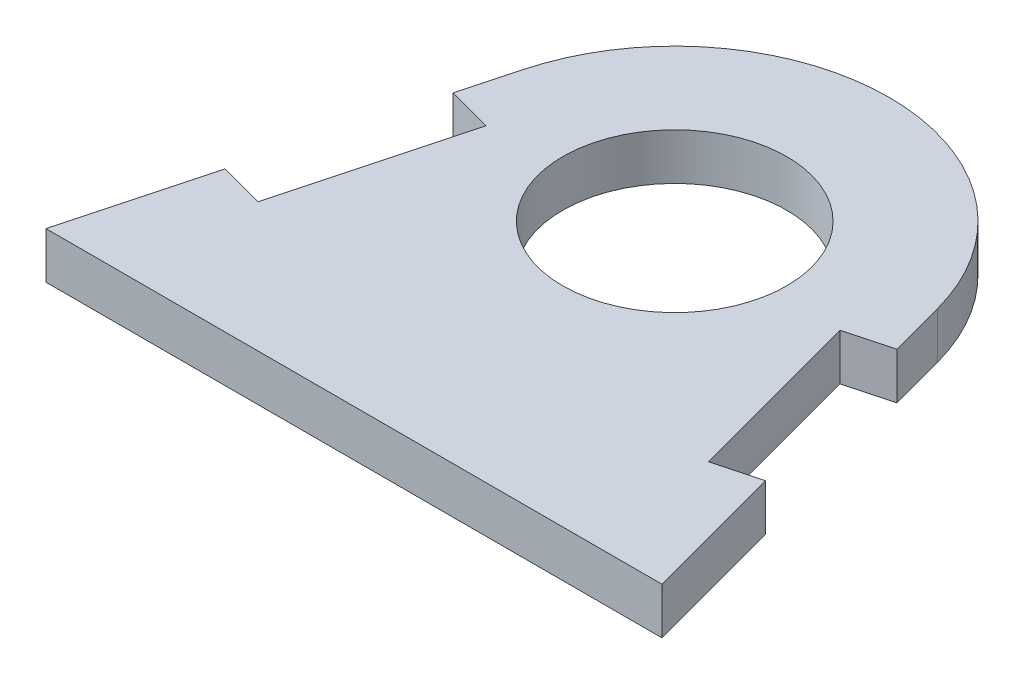
ISO-10303-21;
HEADER;
FILE_DESCRIPTION(('STEP AP214'),'2;1');
FILE_NAME('part.step','',(''),(''),'','','');
FILE_SCHEMA(('AUTOMOTIVE_DESIGN { 1 0 10303 214 1 1 1 1 }'));
ENDSEC;
DATA;
#1=APPLICATION_CONTEXT('core data for automotive mechanical design processes');
#2=APPLICATION_PROTOCOL_DEFINITION('international standard','automotive_design',2000,#1);
#3=PRODUCT_CONTEXT('',#1,'mechanical');
#4=PRODUCT('Part','Part','',(#3));
#5=PRODUCT_RELATED_PRODUCT_CATEGORY('part','',(#4));
#6=PRODUCT_DEFINITION_FORMATION('','',#4);
#7=PRODUCT_DEFINITION_CONTEXT('part definition',#1,'design');
#8=PRODUCT_DEFINITION('design','',#6,#7);
#9=PRODUCT_DEFINITION_SHAPE('','',#8);
#10=(LENGTH_UNIT() NAMED_UNIT(*) SI_UNIT(.MILLI.,.METRE.));
#11=(NAMED_UNIT(*) PLANE_ANGLE_UNIT() SI_UNIT($,.RADIAN.));
#12=(NAMED_UNIT(*) SI_UNIT($,.STERADIAN.) SOLID_ANGLE_UNIT());
#13=UNCERTAINTY_MEASURE_WITH_UNIT(LENGTH_MEASURE(1.E-05),#10,'distance_accuracy_value','');
#14=(GEOMETRIC_REPRESENTATION_CONTEXT(3) GLOBAL_UNCERTAINTY_ASSIGNED_CONTEXT((#13)) GLOBAL_UNIT_ASSIGNED_CONTEXT((#10,
#11,#12)) REPRESENTATION_CONTEXT('',''));
#15=CARTESIAN_POINT('',(0.,0.,0.));
#16=DIRECTION('',(0.,0.,1.));
#17=DIRECTION('',(1.,0.,0.));
#18=AXIS2_PLACEMENT_3D('',#15,#16,#17);
#19=CARTESIAN_POINT('',(0.,1.5875,-21.9125));
#20=DIRECTION('',(0.,-1.,0.));
#21=DIRECTION('',(0.,0.,-1.));
#22=AXIS2_PLACEMENT_3D('',#19,#20,#21);
#23=CYLINDRICAL_SURFACE('',#22,14.65);
#24=CARTESIAN_POINT('',(0.,-1.5875,-21.9125));
#25=DIRECTION('',(0.,1.,0.));
#26=DIRECTION('',(0.,0.,1.));
#27=AXIS2_PLACEMENT_3D('',#24,#25,#26);
#28=CIRCLE('',#27,14.65);
#29=CARTESIAN_POINT('',(-14.1508133551348,-1.5875,-25.704199010752));
#30=VERTEX_POINT('',#29);
#31=CARTESIAN_POINT('',(14.1508133551348,-1.5875,-25.704199010752));
#32=VERTEX_POINT('',#31);
#33=EDGE_CURVE('E162',#30,#32,#28,.F.);
#34=ORIENTED_EDGE('',*,*,#33,.F.);
#35=DIRECTION('',(0.,-1.,0.));
#36=VECTOR('',#35,1.);
#37=CARTESIAN_POINT('',(-14.1508133551348,1.5875,-25.704199010752));
#38=LINE('',#37,#36);
#39=CARTESIAN_POINT('',(-14.1508133551348,1.5875,-25.704199010752));
#40=VERTEX_POINT('',#39);
#41=EDGE_CURVE('E11',#40,#30,#38,.T.);
#42=ORIENTED_EDGE('',*,*,#41,.F.);
#43=CARTESIAN_POINT('',(0.,1.5875,-21.9125));
#44=DIRECTION('',(0.,1.,0.));
#45=DIRECTION('',(0.,0.,1.));
#46=AXIS2_PLACEMENT_3D('',#43,#44,#45);
#47=CIRCLE('',#46,14.65);
#48=CARTESIAN_POINT('',(14.1508133551348,1.5875,-25.704199010752));
#49=VERTEX_POINT('',#48);
#50=EDGE_CURVE('E191',#40,#49,#47,.F.);
#51=ORIENTED_EDGE('',*,*,#50,.T.);
#52=DIRECTION('',(0.,-1.,0.));
#53=VECTOR('',#52,1.);
#54=CARTESIAN_POINT('',(14.1508133551348,1.5875,-25.704199010752));
#55=LINE('',#54,#53);
#56=EDGE_CURVE('E103',#49,#32,#55,.T.);
#57=ORIENTED_EDGE('',*,*,#56,.T.);
#58=EDGE_LOOP('',(#34,#42,#51,#57));
#59=FACE_BOUND('',#58,.T.);
#60=ADVANCED_FACE('F41',(#59),#23,.T.);
#61=CARTESIAN_POINT('',(-19.6289383551349,1.5875,-5.25955818053877));
#62=DIRECTION('',(-0.965925826289067,0.,-0.258819045102524));
#63=DIRECTION('',(-0.258819045102524,0.,0.965925826289067));
#64=AXIS2_PLACEMENT_3D('',#61,#62,#63);
#65=PLANE('',#64);
#66=DIRECTION('',(0.258819045102524,0.,-0.965925826289067));
#67=VECTOR('',#66,1.);
#68=CARTESIAN_POINT('',(-19.6289383551349,-1.5875,-5.25955818053877));
#69=LINE('',#68,#67);
#70=CARTESIAN_POINT('',(-15.1630403983275,-1.5875,-21.9265162567618));
#71=VERTEX_POINT('',#70);
#72=EDGE_CURVE('E165',#71,#30,#69,.T.);
#73=ORIENTED_EDGE('',*,*,#72,.F.);
#74=DIRECTION('',(0.,-1.,0.));
#75=VECTOR('',#74,1.);
#76=CARTESIAN_POINT('',(-15.1630403983275,1.5875,-21.9265162567618));
#77=LINE('',#76,#75);
#78=CARTESIAN_POINT('',(-15.1630403983275,1.5875,-21.9265162567618));
#79=VERTEX_POINT('',#78);
#80=EDGE_CURVE('E49',#79,#71,#77,.T.);
#81=ORIENTED_EDGE('',*,*,#80,.F.);
#82=DIRECTION('',(0.258819045102524,0.,-0.965925826289067));
#83=VECTOR('',#82,1.);
#84=CARTESIAN_POINT('',(-19.6289383551349,1.5875,-5.25955818053877));
#85=LINE('',#84,#83);
#86=EDGE_CURVE('E224',#79,#40,#85,.T.);
#87=ORIENTED_EDGE('',*,*,#86,.T.);
#88=ORIENTED_EDGE('',*,*,#41,.T.);
#89=EDGE_LOOP('',(#73,#81,#87,#88));
#90=FACE_BOUND('',#89,.T.);
#91=ADVANCED_FACE('F223',(#90),#65,.T.);
#92=CARTESIAN_POINT('',(4.46589795680742,1.5875,-16.6669580762231));
#93=DIRECTION('',(0.258819045102525,0.,-0.965925826289067));
#94=DIRECTION('',(-0.965925826289067,0.,-0.258819045102525));
#95=AXIS2_PLACEMENT_3D('',#92,#93,#94);
#96=PLANE('',#95);
#97=DIRECTION('',(0.965925826289067,0.,0.258819045102525));
#98=VECTOR('',#97,1.);
#99=CARTESIAN_POINT('',(4.46589795680742,-1.5875,-16.6669580762231));
#100=LINE('',#99,#98);
#101=CARTESIAN_POINT('',(-12.0962258998597,-1.5875,-21.1047657885613));
#102=VERTEX_POINT('',#101);
#103=EDGE_CURVE('E168',#71,#102,#100,.T.);
#104=ORIENTED_EDGE('',*,*,#103,.T.);
#105=DIRECTION('',(0.,-1.,0.));
#106=VECTOR('',#105,1.);
#107=CARTESIAN_POINT('',(-12.0962258998597,1.5875,-21.1047657885613));
#108=LINE('',#107,#106);
#109=CARTESIAN_POINT('',(-12.0962258998597,1.5875,-21.1047657885613));
#110=VERTEX_POINT('',#109);
#111=EDGE_CURVE('E207',#110,#102,#108,.T.);
#112=ORIENTED_EDGE('',*,*,#111,.F.);
#113=DIRECTION('',(0.965925826289067,0.,0.258819045102525));
#114=VECTOR('',#113,1.);
#115=CARTESIAN_POINT('',(4.46589795680742,1.5875,-16.6669580762231));
#116=LINE('',#115,#114);
#117=EDGE_CURVE('E214',#79,#110,#116,.T.);
#118=ORIENTED_EDGE('',*,*,#117,.F.);
#119=ORIENTED_EDGE('',*,*,#80,.T.);
#120=EDGE_LOOP('',(#104,#112,#118,#119));
#121=FACE_BOUND('',#120,.T.);
#122=ADVANCED_FACE('F212',(#121),#96,.F.);
#123=CARTESIAN_POINT('',(-16.5621238566671,1.5875,-4.43780771233826));
#124=DIRECTION('',(0.965925826289067,0.,0.258819045102524));
#125=DIRECTION('',(0.258819045102525,0.,-0.965925826289067));
#126=AXIS2_PLACEMENT_3D('',#123,#124,#125);
#127=PLANE('',#126);
#128=DIRECTION('',(-0.258819045102525,0.,0.965925826289067));
#129=VECTOR('',#128,1.);
#130=CARTESIAN_POINT('',(-16.5621238566671,-1.5875,-4.43780771233826));
#131=LINE('',#130,#129);
#132=CARTESIAN_POINT('',(-15.3832277726618,-1.5875,-8.83750779469016));
#133=VERTEX_POINT('',#132);
#134=EDGE_CURVE('E171',#102,#133,#131,.T.);
#135=ORIENTED_EDGE('',*,*,#134,.T.);
#136=DIRECTION('',(0.,-1.,0.));
#137=VECTOR('',#136,1.);
#138=CARTESIAN_POINT('',(-15.3832277726618,1.5875,-8.83750779469016));
#139=LINE('',#138,#137);
#140=CARTESIAN_POINT('',(-15.3832277726618,1.5875,-8.83750779469016));
#141=VERTEX_POINT('',#140);
#142=EDGE_CURVE('E205',#141,#133,#139,.T.);
#143=ORIENTED_EDGE('',*,*,#142,.F.);
#144=DIRECTION('',(-0.258819045102525,0.,0.965925826289067));
#145=VECTOR('',#144,1.);
#146=CARTESIAN_POINT('',(-16.5621238566671,1.5875,-4.43780771233826));
#147=LINE('',#146,#145);
#148=EDGE_CURVE('E231',#110,#141,#147,.T.);
#149=ORIENTED_EDGE('',*,*,#148,.F.);
#150=ORIENTED_EDGE('',*,*,#111,.T.);
#151=EDGE_LOOP('',(#135,#143,#149,#150));
#152=FACE_BOUND('',#151,.T.);
#153=ADVANCED_FACE('F262',(#152),#127,.F.);
#154=CARTESIAN_POINT('',(1.17889608400536,1.5875,-4.39970008235191));
#155=DIRECTION('',(0.258819045102524,0.,-0.965925826289067));
#156=DIRECTION('',(-0.965925826289067,0.,-0.258819045102524));
#157=AXIS2_PLACEMENT_3D('',#154,#155,#156);
#158=PLANE('',#157);
#159=DIRECTION('',(0.965925826289067,0.,0.258819045102524));
#160=VECTOR('',#159,1.);
#161=CARTESIAN_POINT('',(1.17889608400536,-1.5875,-4.39970008235191));
#162=LINE('',#161,#160);
#163=CARTESIAN_POINT('',(-18.4500422711296,-1.5875,-9.65925826289068));
#164=VERTEX_POINT('',#163);
#165=EDGE_CURVE('E174',#164,#133,#162,.T.);
#166=ORIENTED_EDGE('',*,*,#165,.F.);
#167=DIRECTION('',(0.,-1.,0.));
#168=VECTOR('',#167,1.);
#169=CARTESIAN_POINT('',(-18.4500422711296,1.5875,-9.65925826289068));
#170=LINE('',#169,#168);
#171=CARTESIAN_POINT('',(-18.4500422711296,1.5875,-9.65925826289068));
#172=VERTEX_POINT('',#171);
#173=EDGE_CURVE('E203',#172,#164,#170,.T.);
#174=ORIENTED_EDGE('',*,*,#173,.F.);
#175=DIRECTION('',(0.965925826289067,0.,0.258819045102524));
#176=VECTOR('',#175,1.);
#177=CARTESIAN_POINT('',(1.17889608400536,1.5875,-4.39970008235191));
#178=LINE('',#177,#176);
#179=EDGE_CURVE('E233',#172,#141,#178,.T.);
#180=ORIENTED_EDGE('',*,*,#179,.T.);
#181=ORIENTED_EDGE('',*,*,#142,.T.);
#182=EDGE_LOOP('',(#166,#174,#180,#181));
#183=FACE_BOUND('',#182,.T.);
#184=ADVANCED_FACE('F258',(#183),#158,.T.);
#185=CARTESIAN_POINT('',(-21.0382327221548,-1.5875,0.));
#186=VERTEX_POINT('',#185);
#187=EDGE_CURVE('E169',#186,#164,#69,.T.);
#188=ORIENTED_EDGE('',*,*,#187,.F.);
#189=DIRECTION('',(0.,-1.,0.));
#190=VECTOR('',#189,1.);
#191=CARTESIAN_POINT('',(-21.0382327221548,1.5875,0.));
#192=LINE('',#191,#190);
#193=CARTESIAN_POINT('',(-21.0382327221548,1.5875,0.));
#194=VERTEX_POINT('',#193);
#195=EDGE_CURVE('E201',#194,#186,#192,.T.);
#196=ORIENTED_EDGE('',*,*,#195,.F.);
#197=EDGE_CURVE('E228',#194,#172,#85,.T.);
#198=ORIENTED_EDGE('',*,*,#197,.T.);
#199=ORIENTED_EDGE('',*,*,#173,.T.);
#200=EDGE_LOOP('',(#188,#196,#198,#199));
#201=FACE_BOUND('',#200,.T.);
#202=ADVANCED_FACE('F253',(#201),#65,.T.);
#203=CARTESIAN_POINT('',(0.,1.5875,0.));
#204=DIRECTION('',(0.,0.,-1.));
#205=DIRECTION('',(-1.,0.,0.));
#206=AXIS2_PLACEMENT_3D('',#203,#204,#205);
#207=PLANE('',#206);
#208=DIRECTION('',(1.,0.,0.));
#209=VECTOR('',#208,1.);
#210=CARTESIAN_POINT('',(0.,-1.5875,0.));
#211=LINE('',#210,#209);
#212=CARTESIAN_POINT('',(21.0382327221548,-1.5875,0.));
#213=VERTEX_POINT('',#212);
#214=EDGE_CURVE('E177',#186,#213,#211,.T.);
#215=ORIENTED_EDGE('',*,*,#214,.T.);
#216=DIRECTION('',(0.,-1.,0.));
#217=VECTOR('',#216,1.);
#218=CARTESIAN_POINT('',(21.0382327221548,1.5875,0.));
#219=LINE('',#218,#217);
#220=CARTESIAN_POINT('',(21.0382327221548,1.5875,0.));
#221=VERTEX_POINT('',#220);
#222=EDGE_CURVE('E198',#221,#213,#219,.T.);
#223=ORIENTED_EDGE('',*,*,#222,.F.);
#224=DIRECTION('',(1.,0.,0.));
#225=VECTOR('',#224,1.);
#226=CARTESIAN_POINT('',(0.,1.5875,0.));
#227=LINE('',#226,#225);
#228=EDGE_CURVE('E236',#194,#221,#227,.T.);
#229=ORIENTED_EDGE('',*,*,#228,.F.);
#230=ORIENTED_EDGE('',*,*,#195,.T.);
#231=EDGE_LOOP('',(#215,#223,#229,#230));
#232=FACE_BOUND('',#231,.T.);
#233=ADVANCED_FACE('F279',(#232),#207,.F.);
#234=CARTESIAN_POINT('',(19.6289383551349,1.5875,-5.25955818053878));
#235=DIRECTION('',(-0.965925826289067,0.,0.258819045102525));
#236=DIRECTION('',(0.258819045102525,0.,0.965925826289067));
#237=AXIS2_PLACEMENT_3D('',#234,#235,#236);
#238=PLANE('',#237);
#239=DIRECTION('',(-0.258819045102525,0.,-0.965925826289067));
#240=VECTOR('',#239,1.);
#241=CARTESIAN_POINT('',(19.6289383551349,-1.5875,-5.25955818053878));
#242=LINE('',#241,#240);
#243=CARTESIAN_POINT('',(18.4500422711295,-1.5875,-9.65925826289068));
#244=VERTEX_POINT('',#243);
#245=EDGE_CURVE('E179',#213,#244,#242,.T.);
#246=ORIENTED_EDGE('',*,*,#245,.T.);
#247=DIRECTION('',(0.,-1.,0.));
#248=VECTOR('',#247,1.);
#249=CARTESIAN_POINT('',(18.4500422711295,1.5875,-9.65925826289068));
#250=LINE('',#249,#248);
#251=CARTESIAN_POINT('',(18.4500422711295,1.5875,-9.65925826289068));
#252=VERTEX_POINT('',#251);
#253=EDGE_CURVE('E195',#252,#244,#250,.T.);
#254=ORIENTED_EDGE('',*,*,#253,.F.);
#255=DIRECTION('',(-0.258819045102525,0.,-0.965925826289067));
#256=VECTOR('',#255,1.);
#257=CARTESIAN_POINT('',(19.6289383551349,1.5875,-5.25955818053878));
#258=LINE('',#257,#256);
#259=EDGE_CURVE('E157',#221,#252,#258,.T.);
#260=ORIENTED_EDGE('',*,*,#259,.F.);
#261=ORIENTED_EDGE('',*,*,#222,.T.);
#262=EDGE_LOOP('',(#246,#254,#260,#261));
#263=FACE_BOUND('',#262,.T.);
#264=ADVANCED_FACE('F243',(#263),#238,.F.);
#265=CARTESIAN_POINT('',(-1.17889608400536,1.5875,-4.39970008235191));
#266=DIRECTION('',(0.258819045102524,0.,0.965925826289067));
#267=DIRECTION('',(0.965925826289067,0.,-0.258819045102524));
#268=AXIS2_PLACEMENT_3D('',#265,#266,#267);
#269=PLANE('',#268);
#270=DIRECTION('',(-0.965925826289067,0.,0.258819045102524));
#271=VECTOR('',#270,1.);
#272=CARTESIAN_POINT('',(-1.17889608400536,-1.5875,-4.39970008235191));
#273=LINE('',#272,#271);
#274=CARTESIAN_POINT('',(15.3832277726618,-1.5875,-8.83750779469016));
#275=VERTEX_POINT('',#274);
#276=EDGE_CURVE('E181',#244,#275,#273,.T.);
#277=ORIENTED_EDGE('',*,*,#276,.T.);
#278=DIRECTION('',(0.,-1.,0.));
#279=VECTOR('',#278,1.);
#280=CARTESIAN_POINT('',(15.3832277726618,1.5875,-8.83750779469016));
#281=LINE('',#280,#279);
#282=CARTESIAN_POINT('',(15.3832277726618,1.5875,-8.83750779469016));
#283=VERTEX_POINT('',#282);
#284=EDGE_CURVE('E144',#283,#275,#281,.T.);
#285=ORIENTED_EDGE('',*,*,#284,.F.);
#286=DIRECTION('',(-0.965925826289067,0.,0.258819045102524));
#287=VECTOR('',#286,1.);
#288=CARTESIAN_POINT('',(-1.17889608400536,1.5875,-4.39970008235191));
#289=LINE('',#288,#287);
#290=EDGE_CURVE('E150',#252,#283,#289,.T.);
#291=ORIENTED_EDGE('',*,*,#290,.F.);
#292=ORIENTED_EDGE('',*,*,#253,.T.);
#293=EDGE_LOOP('',(#277,#285,#291,#292));
#294=FACE_BOUND('',#293,.T.);
#295=ADVANCED_FACE('F247',(#294),#269,.F.);
#296=CARTESIAN_POINT('',(16.5621238566671,1.5875,-4.43780771233826));
#297=DIRECTION('',(0.965925826289067,0.,-0.258819045102525));
#298=DIRECTION('',(-0.258819045102525,0.,-0.965925826289067));
#299=AXIS2_PLACEMENT_3D('',#296,#297,#298);
#300=PLANE('',#299);
#301=DIRECTION('',(0.258819045102525,0.,0.965925826289067));
#302=VECTOR('',#301,1.);
#303=CARTESIAN_POINT('',(16.5621238566671,-1.5875,-4.43780771233826));
#304=LINE('',#303,#302);
#305=CARTESIAN_POINT('',(12.0962258998597,-1.5875,-21.1047657885613));
#306=VERTEX_POINT('',#305);
#307=EDGE_CURVE('E139',#306,#275,#304,.T.);
#308=ORIENTED_EDGE('',*,*,#307,.F.);
#309=DIRECTION('',(0.,-1.,0.));
#310=VECTOR('',#309,1.);
#311=CARTESIAN_POINT('',(12.0962258998597,1.5875,-21.1047657885613));
#312=LINE('',#311,#310);
#313=CARTESIAN_POINT('',(12.0962258998597,1.5875,-21.1047657885613));
#314=VERTEX_POINT('',#313);
#315=EDGE_CURVE('E134',#314,#306,#312,.T.);
#316=ORIENTED_EDGE('',*,*,#315,.F.);
#317=DIRECTION('',(0.258819045102525,0.,0.965925826289067));
#318=VECTOR('',#317,1.);
#319=CARTESIAN_POINT('',(16.5621238566671,1.5875,-4.43780771233826));
#320=LINE('',#319,#318);
#321=EDGE_CURVE('E137',#314,#283,#320,.T.);
#322=ORIENTED_EDGE('',*,*,#321,.T.);
#323=ORIENTED_EDGE('',*,*,#284,.T.);
#324=EDGE_LOOP('',(#308,#316,#322,#323));
#325=FACE_BOUND('',#324,.T.);
#326=ADVANCED_FACE('F136',(#325),#300,.T.);
#327=CARTESIAN_POINT('',(-4.46589795680742,1.5875,-16.6669580762231));
#328=DIRECTION('',(0.258819045102525,0.,0.965925826289067));
#329=DIRECTION('',(0.965925826289067,0.,-0.258819045102525));
#330=AXIS2_PLACEMENT_3D('',#327,#328,#329);
#331=PLANE('',#330);
#332=DIRECTION('',(-0.965925826289067,0.,0.258819045102525));
#333=VECTOR('',#332,1.);
#334=CARTESIAN_POINT('',(-4.46589795680742,-1.5875,-16.6669580762231));
#335=LINE('',#334,#333);
#336=CARTESIAN_POINT('',(15.1630403983275,-1.5875,-21.9265162567618));
#337=VERTEX_POINT('',#336);
#338=EDGE_CURVE('E186',#337,#306,#335,.T.);
#339=ORIENTED_EDGE('',*,*,#338,.F.);
#340=DIRECTION('',(0.,-1.,0.));
#341=VECTOR('',#340,1.);
#342=CARTESIAN_POINT('',(15.1630403983275,1.5875,-21.9265162567618));
#343=LINE('',#342,#341);
#344=CARTESIAN_POINT('',(15.1630403983275,1.5875,-21.9265162567618));
#345=VERTEX_POINT('',#344);
#346=EDGE_CURVE('E96',#345,#337,#343,.T.);
#347=ORIENTED_EDGE('',*,*,#346,.F.);
#348=DIRECTION('',(-0.965925826289067,0.,0.258819045102525));
#349=VECTOR('',#348,1.);
#350=CARTESIAN_POINT('',(-4.46589795680742,1.5875,-16.6669580762231));
#351=LINE('',#350,#349);
#352=EDGE_CURVE('E148',#345,#314,#351,.T.);
#353=ORIENTED_EDGE('',*,*,#352,.T.);
#354=ORIENTED_EDGE('',*,*,#315,.T.);
#355=EDGE_LOOP('',(#339,#347,#353,#354));
#356=FACE_BOUND('',#355,.T.);
#357=ADVANCED_FACE('F153',(#356),#331,.T.);
#358=EDGE_CURVE('E182',#337,#32,#242,.T.);
#359=ORIENTED_EDGE('',*,*,#358,.T.);
#360=ORIENTED_EDGE('',*,*,#56,.F.);
#361=EDGE_CURVE('E57',#345,#49,#258,.T.);
#362=ORIENTED_EDGE('',*,*,#361,.F.);
#363=ORIENTED_EDGE('',*,*,#346,.T.);
#364=EDGE_LOOP('',(#359,#360,#362,#363));
#365=FACE_BOUND('',#364,.T.);
#366=ADVANCED_FACE('F225',(#365),#238,.F.);
#367=CARTESIAN_POINT('',(0.,1.5875,-21.9125));
#368=DIRECTION('',(0.,-1.,0.));
#369=DIRECTION('',(0.,0.,-1.));
#370=AXIS2_PLACEMENT_3D('',#367,#368,#369);
#371=CYLINDRICAL_SURFACE('',#370,7.65);
#372=CARTESIAN_POINT('',(0.,1.5875,-21.9125));
#373=DIRECTION('',(0.,1.,0.));
#374=DIRECTION('',(0.,0.,1.));
#375=AXIS2_PLACEMENT_3D('',#372,#373,#374);
#376=CIRCLE('',#375,7.65);
#377=CARTESIAN_POINT('',(0.,1.5875,-14.2625));
#378=VERTEX_POINT('',#377);
#379=EDGE_CURVE('E155',#378,#378,#376,.T.);
#380=ORIENTED_EDGE('',*,*,#379,.T.);
#381=EDGE_LOOP('',(#380));
#382=FACE_BOUND('',#381,.T.);
#383=CARTESIAN_POINT('',(0.,-1.5875,-21.9125));
#384=DIRECTION('',(0.,1.,0.));
#385=DIRECTION('',(0.,0.,1.));
#386=AXIS2_PLACEMENT_3D('',#383,#384,#385);
#387=CIRCLE('',#386,7.65);
#388=CARTESIAN_POINT('',(0.,-1.5875,-14.2625));
#389=VERTEX_POINT('',#388);
#390=EDGE_CURVE('E188',#389,#389,#387,.T.);
#391=ORIENTED_EDGE('',*,*,#390,.F.);
#392=EDGE_LOOP('',(#391));
#393=FACE_BOUND('',#392,.T.);
#394=ADVANCED_FACE('F295',(#382,#393),#371,.F.);
#395=CARTESIAN_POINT('',(0.,1.5875,0.));
#396=DIRECTION('',(0.,1.,0.));
#397=DIRECTION('',(0.,0.,1.));
#398=AXIS2_PLACEMENT_3D('',#395,#396,#397);
#399=PLANE('',#398);
#400=ORIENTED_EDGE('',*,*,#50,.F.);
#401=ORIENTED_EDGE('',*,*,#86,.F.);
#402=ORIENTED_EDGE('',*,*,#117,.T.);
#403=ORIENTED_EDGE('',*,*,#148,.T.);
#404=ORIENTED_EDGE('',*,*,#179,.F.);
#405=ORIENTED_EDGE('',*,*,#197,.F.);
#406=ORIENTED_EDGE('',*,*,#228,.T.);
#407=ORIENTED_EDGE('',*,*,#259,.T.);
#408=ORIENTED_EDGE('',*,*,#290,.T.);
#409=ORIENTED_EDGE('',*,*,#321,.F.);
#410=ORIENTED_EDGE('',*,*,#352,.F.);
#411=ORIENTED_EDGE('',*,*,#361,.T.);
#412=EDGE_LOOP('',(#400,#401,#402,#403,#404,#405,#406,#407,#408,#409,#410,#411));
#413=FACE_BOUND('',#412,.T.);
#414=ORIENTED_EDGE('',*,*,#379,.F.);
#415=EDGE_LOOP('',(#414));
#416=FACE_BOUND('',#415,.T.);
#417=ADVANCED_FACE('F146',(#413,#416),#399,.T.);
#418=CARTESIAN_POINT('',(0.,-1.5875,0.));
#419=DIRECTION('',(0.,1.,0.));
#420=DIRECTION('',(0.,0.,1.));
#421=AXIS2_PLACEMENT_3D('',#418,#419,#420);
#422=PLANE('',#421);
#423=ORIENTED_EDGE('',*,*,#33,.T.);
#424=ORIENTED_EDGE('',*,*,#358,.F.);
#425=ORIENTED_EDGE('',*,*,#338,.T.);
#426=ORIENTED_EDGE('',*,*,#307,.T.);
#427=ORIENTED_EDGE('',*,*,#276,.F.);
#428=ORIENTED_EDGE('',*,*,#245,.F.);
#429=ORIENTED_EDGE('',*,*,#214,.F.);
#430=ORIENTED_EDGE('',*,*,#187,.T.);
#431=ORIENTED_EDGE('',*,*,#165,.T.);
#432=ORIENTED_EDGE('',*,*,#134,.F.);
#433=ORIENTED_EDGE('',*,*,#103,.F.);
#434=ORIENTED_EDGE('',*,*,#72,.T.);
#435=EDGE_LOOP('',(#423,#424,#425,#426,#427,#428,#429,#430,#431,#432,#433,#434));
#436=FACE_BOUND('',#435,.T.);
#437=ORIENTED_EDGE('',*,*,#390,.T.);
#438=EDGE_LOOP('',(#437));
#439=FACE_BOUND('',#438,.T.);
#440=ADVANCED_FACE('F221',(#436,#439),#422,.F.);
#441=CLOSED_SHELL('',(#60,#91,#122,#153,#184,#202,#233,#264,#295,#326,#357,#366,#394,#417,#440));
#442=MANIFOLD_SOLID_BREP('B2',#441);
#443=ADVANCED_BREP_SHAPE_REPRESENTATION('',(#18,#442),#14);
#444=SHAPE_DEFINITION_REPRESENTATION(#9,#443);
ENDSEC;
END-ISO-10303-21;
